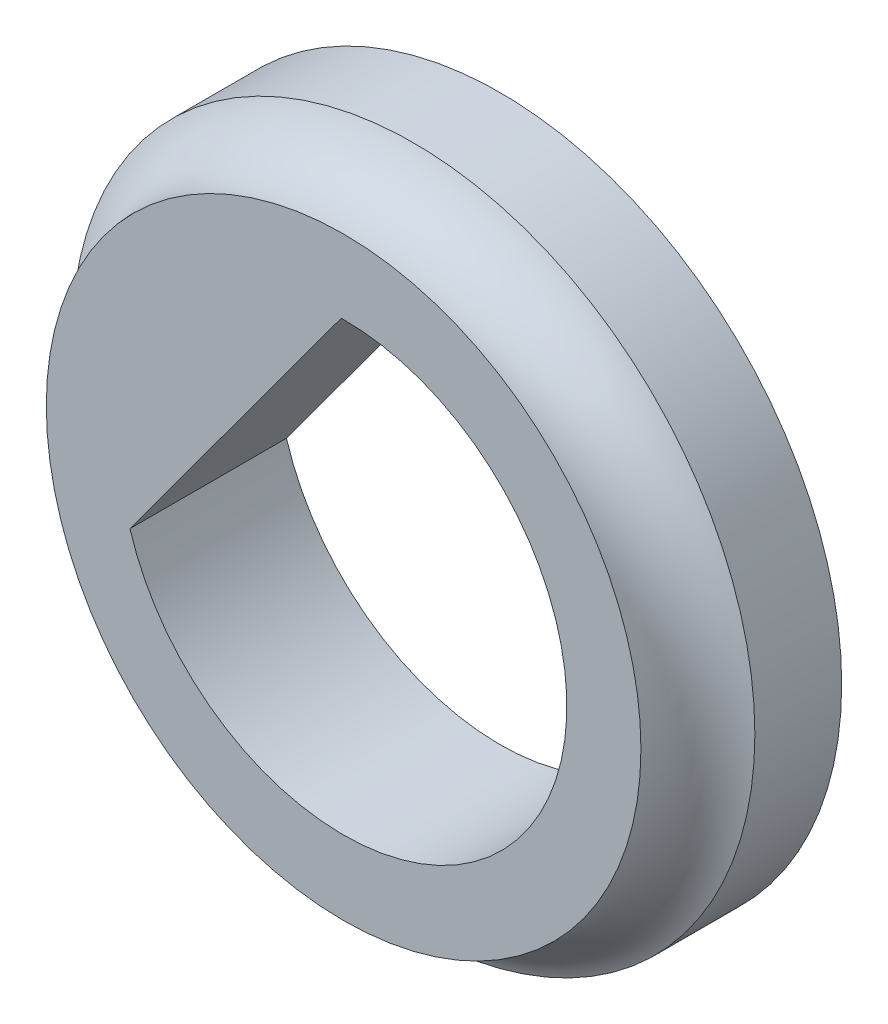
ISO-10303-21;
HEADER;
FILE_DESCRIPTION(('STEP AP214'),'2;1');
FILE_NAME('part.step','',(''),(''),'','','');
FILE_SCHEMA(('AUTOMOTIVE_DESIGN { 1 0 10303 214 1 1 1 1 }'));
ENDSEC;
DATA;
#1=APPLICATION_CONTEXT('core data for automotive mechanical design processes');
#2=APPLICATION_PROTOCOL_DEFINITION('international standard','automotive_design',2000,#1);
#3=PRODUCT_CONTEXT('',#1,'mechanical');
#4=PRODUCT('Part','Part','',(#3));
#5=PRODUCT_RELATED_PRODUCT_CATEGORY('part','',(#4));
#6=PRODUCT_DEFINITION_FORMATION('','',#4);
#7=PRODUCT_DEFINITION_CONTEXT('part definition',#1,'design');
#8=PRODUCT_DEFINITION('design','',#6,#7);
#9=PRODUCT_DEFINITION_SHAPE('','',#8);
#10=(LENGTH_UNIT() NAMED_UNIT(*) SI_UNIT(.MILLI.,.METRE.));
#11=(NAMED_UNIT(*) PLANE_ANGLE_UNIT() SI_UNIT($,.RADIAN.));
#12=(NAMED_UNIT(*) SI_UNIT($,.STERADIAN.) SOLID_ANGLE_UNIT());
#13=UNCERTAINTY_MEASURE_WITH_UNIT(LENGTH_MEASURE(1.E-05),#10,'distance_accuracy_value','');
#14=(GEOMETRIC_REPRESENTATION_CONTEXT(3) GLOBAL_UNCERTAINTY_ASSIGNED_CONTEXT((#13)) GLOBAL_UNIT_ASSIGNED_CONTEXT((#10,
#11,#12)) REPRESENTATION_CONTEXT('',''));
#15=CARTESIAN_POINT('',(0.,0.,0.));
#16=DIRECTION('',(0.,0.,1.));
#17=DIRECTION('',(1.,0.,0.));
#18=AXIS2_PLACEMENT_3D('',#15,#16,#17);
#19=CARTESIAN_POINT('',(0.,0.,0.));
#20=DIRECTION('',(0.,0.,1.));
#21=DIRECTION('',(1.,0.,0.));
#22=AXIS2_PLACEMENT_3D('',#19,#20,#21);
#23=TOROIDAL_SURFACE('',#22,16.75,3.43265291781274);
#24=CARTESIAN_POINT('',(0.,0.,0.0107761984166474));
#25=DIRECTION('',(0.,0.,1.));
#26=DIRECTION('',(1.,0.,0.));
#27=AXIS2_PLACEMENT_3D('',#24,#25,#26);
#28=CIRCLE('',#27,13.3173639972004);
#29=CARTESIAN_POINT('',(13.3173639972004,0.,0.0107761984166474));
#30=VERTEX_POINT('',#29);
#31=EDGE_CURVE('E67',#30,#30,#28,.F.);
#32=ORIENTED_EDGE('',*,*,#31,.T.);
#33=EDGE_LOOP('',(#32));
#34=FACE_BOUND('',#33,.T.);
#35=CARTESIAN_POINT('',(0.,0.,-3.11111111111112));
#36=DIRECTION('',(0.,0.,1.));
#37=DIRECTION('',(1.,0.,0.));
#38=AXIS2_PLACEMENT_3D('',#35,#36,#37);
#39=CIRCLE('',#38,15.2994505494505);
#40=CARTESIAN_POINT('',(15.2994505494505,0.,-3.11111111111112));
#41=VERTEX_POINT('',#40);
#42=EDGE_CURVE('E11',#41,#41,#39,.T.);
#43=ORIENTED_EDGE('',*,*,#42,.T.);
#44=EDGE_LOOP('',(#43));
#45=FACE_BOUND('',#44,.T.);
#46=ADVANCED_FACE('F36',(#34,#45),#23,.F.);
#47=CARTESIAN_POINT('',(0.,0.,7.));
#48=DIRECTION('',(0.,0.,1.));
#49=DIRECTION('',(1.,0.,0.));
#50=AXIS2_PLACEMENT_3D('',#47,#48,#49);
#51=CYLINDRICAL_SURFACE('',#50,15.2994505494506);
#52=ORIENTED_EDGE('',*,*,#42,.F.);
#53=EDGE_LOOP('',(#52));
#54=FACE_BOUND('',#53,.T.);
#55=CARTESIAN_POINT('',(0.,0.,-7.));
#56=DIRECTION('',(0.,0.,1.));
#57=DIRECTION('',(1.,0.,0.));
#58=AXIS2_PLACEMENT_3D('',#55,#56,#57);
#59=CIRCLE('',#58,15.2994505494506);
#60=CARTESIAN_POINT('',(15.2994505494506,0.,-7.));
#61=VERTEX_POINT('',#60);
#62=EDGE_CURVE('E44',#61,#61,#59,.T.);
#63=ORIENTED_EDGE('',*,*,#62,.T.);
#64=EDGE_LOOP('',(#63));
#65=FACE_BOUND('',#64,.T.);
#66=ADVANCED_FACE('F86',(#54,#65),#51,.T.);
#67=CARTESIAN_POINT('',(0.,10.7,-7.));
#68=DIRECTION('',(0.,0.,1.));
#69=DIRECTION('',(1.,0.,0.));
#70=AXIS2_PLACEMENT_3D('',#67,#68,#69);
#71=PLANE('',#70);
#72=ORIENTED_EDGE('',*,*,#62,.F.);
#73=EDGE_LOOP('',(#72));
#74=FACE_BOUND('',#73,.T.);
#75=CARTESIAN_POINT('',(0.,0.,-7.));
#76=DIRECTION('',(0.,0.,1.));
#77=DIRECTION('',(1.,0.,0.));
#78=AXIS2_PLACEMENT_3D('',#75,#76,#77);
#79=CIRCLE('',#78,10.);
#80=CARTESIAN_POINT('',(-9.57075513297573,-2.89838682453165,-7.));
#81=VERTEX_POINT('',#80);
#82=CARTESIAN_POINT('',(-0.102639914317167,9.99947323852557,-7.));
#83=VERTEX_POINT('',#82);
#84=EDGE_CURVE('E51',#81,#83,#79,.T.);
#85=ORIENTED_EDGE('',*,*,#84,.T.);
#86=DIRECTION('',(0.59175720116616,0.806116253941076,0.));
#87=VECTOR('',#86,1.);
#88=CARTESIAN_POINT('',(-0.102639914317167,9.99947323852556,-7.));
#89=LINE('',#88,#87);
#90=EDGE_CURVE('E73',#81,#83,#89,.T.);
#91=ORIENTED_EDGE('',*,*,#90,.F.);
#92=EDGE_LOOP('',(#85,#91));
#93=FACE_BOUND('',#92,.T.);
#94=ADVANCED_FACE('F88',(#74,#93),#71,.F.);
#95=CARTESIAN_POINT('',(0.,0.,7.));
#96=DIRECTION('',(0.,0.,1.));
#97=DIRECTION('',(1.,0.,0.));
#98=AXIS2_PLACEMENT_3D('',#95,#96,#97);
#99=CYLINDRICAL_SURFACE('',#98,9.99999999999999);
#100=CARTESIAN_POINT('',(0.,0.,0.0107761984166474));
#101=DIRECTION('',(0.,0.,-1.));
#102=DIRECTION('',(-1.,0.,0.));
#103=AXIS2_PLACEMENT_3D('',#100,#101,#102);
#104=CIRCLE('',#103,9.99999999999999);
#105=CARTESIAN_POINT('',(-9.57075513297573,-2.89838682453165,0.0107761984166474));
#106=VERTEX_POINT('',#105);
#107=CARTESIAN_POINT('',(-0.10263991431717,9.99947323852556,0.0107761984166474));
#108=VERTEX_POINT('',#107);
#109=EDGE_CURVE('E39',#106,#108,#104,.F.);
#110=ORIENTED_EDGE('',*,*,#109,.T.);
#111=DIRECTION('',(0.,0.,1.));
#112=VECTOR('',#111,1.);
#113=CARTESIAN_POINT('',(-0.102639914317167,9.99947323852556,-7.));
#114=LINE('',#113,#112);
#115=EDGE_CURVE('E56',#83,#108,#114,.T.);
#116=ORIENTED_EDGE('',*,*,#115,.F.);
#117=ORIENTED_EDGE('',*,*,#84,.F.);
#118=DIRECTION('',(0.,0.,1.));
#119=VECTOR('',#118,1.);
#120=CARTESIAN_POINT('',(-9.57075513297573,-2.89838682453165,-7.));
#121=LINE('',#120,#119);
#122=EDGE_CURVE('E68',#81,#106,#121,.T.);
#123=ORIENTED_EDGE('',*,*,#122,.T.);
#124=EDGE_LOOP('',(#110,#116,#117,#123));
#125=FACE_BOUND('',#124,.T.);
#126=ADVANCED_FACE('F69',(#125),#99,.F.);
#127=CARTESIAN_POINT('',(-18.7976088830021,-15.2994505494506,0.0107761984166474));
#128=DIRECTION('',(0.,0.,-1.));
#129=DIRECTION('',(-1.,0.,0.));
#130=AXIS2_PLACEMENT_3D('',#127,#128,#129);
#131=PLANE('',#130);
#132=ORIENTED_EDGE('',*,*,#109,.F.);
#133=DIRECTION('',(0.59175720116616,0.806116253941076,0.));
#134=VECTOR('',#133,1.);
#135=CARTESIAN_POINT('',(-0.102639914317167,9.99947323852556,0.0107761984166474));
#136=LINE('',#135,#134);
#137=EDGE_CURVE('E66',#106,#108,#136,.T.);
#138=ORIENTED_EDGE('',*,*,#137,.T.);
#139=EDGE_LOOP('',(#132,#138));
#140=FACE_BOUND('',#139,.T.);
#141=ORIENTED_EDGE('',*,*,#31,.F.);
#142=EDGE_LOOP('',(#141));
#143=FACE_BOUND('',#142,.T.);
#144=ADVANCED_FACE('F63',(#140,#143),#131,.F.);
#145=CARTESIAN_POINT('',(-0.102639914317167,9.99947323852556,-7.));
#146=DIRECTION('',(0.806116253941076,-0.59175720116616,0.));
#147=DIRECTION('',(0.59175720116616,0.806116253941076,0.));
#148=AXIS2_PLACEMENT_3D('',#145,#146,#147);
#149=PLANE('',#148);
#150=ORIENTED_EDGE('',*,*,#137,.F.);
#151=ORIENTED_EDGE('',*,*,#122,.F.);
#152=ORIENTED_EDGE('',*,*,#90,.T.);
#153=ORIENTED_EDGE('',*,*,#115,.T.);
#154=EDGE_LOOP('',(#150,#151,#152,#153));
#155=FACE_BOUND('',#154,.T.);
#156=ADVANCED_FACE('F75',(#155),#149,.T.);
#157=CLOSED_SHELL('',(#46,#66,#94,#126,#144,#156));
#158=MANIFOLD_SOLID_BREP('B2',#157);
#159=ADVANCED_BREP_SHAPE_REPRESENTATION('',(#18,#158),#14);
#160=SHAPE_DEFINITION_REPRESENTATION(#9,#159);
ENDSEC;
END-ISO-10303-21;
